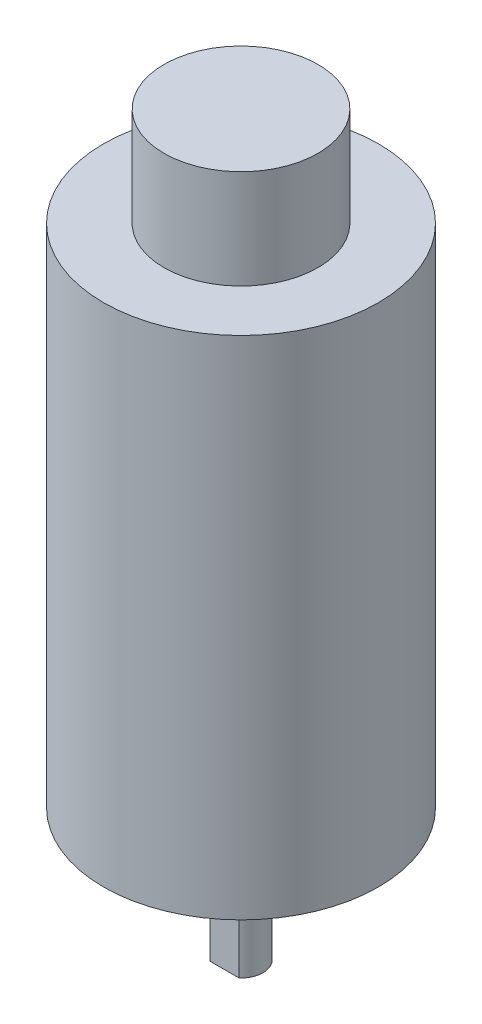
ISO-10303-21;
HEADER;
FILE_DESCRIPTION(('STEP AP214'),'2;1');
FILE_NAME('part.step','',(''),(''),'','','');
FILE_SCHEMA(('AUTOMOTIVE_DESIGN { 1 0 10303 214 1 1 1 1 }'));
ENDSEC;
DATA;
#1=APPLICATION_CONTEXT('core data for automotive mechanical design processes');
#2=APPLICATION_PROTOCOL_DEFINITION('international standard','automotive_design',2000,#1);
#3=PRODUCT_CONTEXT('',#1,'mechanical');
#4=PRODUCT('Part','Part','',(#3));
#5=PRODUCT_RELATED_PRODUCT_CATEGORY('part','',(#4));
#6=PRODUCT_DEFINITION_FORMATION('','',#4);
#7=PRODUCT_DEFINITION_CONTEXT('part definition',#1,'design');
#8=PRODUCT_DEFINITION('design','',#6,#7);
#9=PRODUCT_DEFINITION_SHAPE('','',#8);
#10=(LENGTH_UNIT() NAMED_UNIT(*) SI_UNIT(.MILLI.,.METRE.));
#11=(NAMED_UNIT(*) PLANE_ANGLE_UNIT() SI_UNIT($,.RADIAN.));
#12=(NAMED_UNIT(*) SI_UNIT($,.STERADIAN.) SOLID_ANGLE_UNIT());
#13=UNCERTAINTY_MEASURE_WITH_UNIT(LENGTH_MEASURE(1.E-05),#10,'distance_accuracy_value','');
#14=(GEOMETRIC_REPRESENTATION_CONTEXT(3) GLOBAL_UNCERTAINTY_ASSIGNED_CONTEXT((#13)) GLOBAL_UNIT_ASSIGNED_CONTEXT((#10,
#11,#12)) REPRESENTATION_CONTEXT('',''));
#15=CARTESIAN_POINT('',(0.,0.,0.));
#16=DIRECTION('',(0.,0.,1.));
#17=DIRECTION('',(1.,0.,0.));
#18=AXIS2_PLACEMENT_3D('',#15,#16,#17);
#19=CARTESIAN_POINT('',(0.,46.,0.));
#20=DIRECTION('',(0.,-1.,0.));
#21=DIRECTION('',(0.,0.,-1.));
#22=AXIS2_PLACEMENT_3D('',#19,#20,#21);
#23=CYLINDRICAL_SURFACE('',#22,12.5);
#24=CARTESIAN_POINT('',(0.,46.,0.));
#25=DIRECTION('',(0.,1.,0.));
#26=DIRECTION('',(0.,0.,1.));
#27=AXIS2_PLACEMENT_3D('',#24,#25,#26);
#28=CIRCLE('',#27,12.5);
#29=CARTESIAN_POINT('',(0.,46.,12.5));
#30=VERTEX_POINT('',#29);
#31=EDGE_CURVE('E47',#30,#30,#28,.T.);
#32=ORIENTED_EDGE('',*,*,#31,.F.);
#33=EDGE_LOOP('',(#32));
#34=FACE_BOUND('',#33,.T.);
#35=CARTESIAN_POINT('',(0.,0.,0.));
#36=DIRECTION('',(0.,1.,0.));
#37=DIRECTION('',(0.,0.,1.));
#38=AXIS2_PLACEMENT_3D('',#35,#36,#37);
#39=CIRCLE('',#38,12.5);
#40=CARTESIAN_POINT('',(0.,0.,12.5));
#41=VERTEX_POINT('',#40);
#42=EDGE_CURVE('E42',#41,#41,#39,.T.);
#43=ORIENTED_EDGE('',*,*,#42,.T.);
#44=EDGE_LOOP('',(#43));
#45=FACE_BOUND('',#44,.T.);
#46=ADVANCED_FACE('F39',(#34,#45),#23,.T.);
#47=CARTESIAN_POINT('',(0.,46.,0.));
#48=DIRECTION('',(0.,1.,0.));
#49=DIRECTION('',(0.,0.,1.));
#50=AXIS2_PLACEMENT_3D('',#47,#48,#49);
#51=PLANE('',#50);
#52=CARTESIAN_POINT('',(0.,46.,0.));
#53=DIRECTION('',(0.,1.,0.));
#54=DIRECTION('',(0.,0.,1.));
#55=AXIS2_PLACEMENT_3D('',#52,#53,#54);
#56=CIRCLE('',#55,7.);
#57=CARTESIAN_POINT('',(0.,46.,7.));
#58=VERTEX_POINT('',#57);
#59=EDGE_CURVE('E11',#58,#58,#56,.T.);
#60=ORIENTED_EDGE('',*,*,#59,.F.);
#61=EDGE_LOOP('',(#60));
#62=FACE_BOUND('',#61,.T.);
#63=ORIENTED_EDGE('',*,*,#31,.T.);
#64=EDGE_LOOP('',(#63));
#65=FACE_BOUND('',#64,.T.);
#66=ADVANCED_FACE('F105',(#62,#65),#51,.T.);
#67=CARTESIAN_POINT('',(0.,0.,0.));
#68=DIRECTION('',(0.,1.,0.));
#69=DIRECTION('',(0.,0.,1.));
#70=AXIS2_PLACEMENT_3D('',#67,#68,#69);
#71=PLANE('',#70);
#72=CARTESIAN_POINT('',(0.,0.,-8.5));
#73=DIRECTION('',(0.,1.,0.));
#74=DIRECTION('',(0.,0.,1.));
#75=AXIS2_PLACEMENT_3D('',#72,#73,#74);
#76=CIRCLE('',#75,1.5);
#77=CARTESIAN_POINT('',(0.,0.,-7.));
#78=VERTEX_POINT('',#77);
#79=EDGE_CURVE('E234',#78,#78,#76,.T.);
#80=ORIENTED_EDGE('',*,*,#79,.T.);
#81=EDGE_LOOP('',(#80));
#82=FACE_BOUND('',#81,.T.);
#83=CARTESIAN_POINT('',(0.,0.,8.5));
#84=DIRECTION('',(0.,1.,0.));
#85=DIRECTION('',(0.,0.,1.));
#86=AXIS2_PLACEMENT_3D('',#83,#84,#85);
#87=CIRCLE('',#86,1.5);
#88=CARTESIAN_POINT('',(0.,0.,10.));
#89=VERTEX_POINT('',#88);
#90=EDGE_CURVE('E236',#89,#89,#87,.T.);
#91=ORIENTED_EDGE('',*,*,#90,.T.);
#92=EDGE_LOOP('',(#91));
#93=FACE_BOUND('',#92,.T.);
#94=CARTESIAN_POINT('',(0.,0.,0.));
#95=DIRECTION('',(0.,1.,0.));
#96=DIRECTION('',(0.,0.,1.));
#97=AXIS2_PLACEMENT_3D('',#94,#95,#96);
#98=CIRCLE('',#97,3.5);
#99=CARTESIAN_POINT('',(0.,0.,3.5));
#100=VERTEX_POINT('',#99);
#101=EDGE_CURVE('E84',#100,#100,#98,.T.);
#102=ORIENTED_EDGE('',*,*,#101,.T.);
#103=EDGE_LOOP('',(#102));
#104=FACE_BOUND('',#103,.T.);
#105=ORIENTED_EDGE('',*,*,#42,.F.);
#106=EDGE_LOOP('',(#105));
#107=FACE_BOUND('',#106,.T.);
#108=ADVANCED_FACE('F102',(#82,#93,#104,#107),#71,.F.);
#109=CARTESIAN_POINT('',(0.,55.,0.));
#110=DIRECTION('',(0.,-1.,0.));
#111=DIRECTION('',(0.,0.,-1.));
#112=AXIS2_PLACEMENT_3D('',#109,#110,#111);
#113=CYLINDRICAL_SURFACE('',#112,7.);
#114=CARTESIAN_POINT('',(0.,55.,0.));
#115=DIRECTION('',(0.,1.,0.));
#116=DIRECTION('',(0.,0.,1.));
#117=AXIS2_PLACEMENT_3D('',#114,#115,#116);
#118=CIRCLE('',#117,7.);
#119=CARTESIAN_POINT('',(0.,55.,7.));
#120=VERTEX_POINT('',#119);
#121=EDGE_CURVE('E91',#120,#120,#118,.T.);
#122=ORIENTED_EDGE('',*,*,#121,.F.);
#123=EDGE_LOOP('',(#122));
#124=FACE_BOUND('',#123,.T.);
#125=ORIENTED_EDGE('',*,*,#59,.T.);
#126=EDGE_LOOP('',(#125));
#127=FACE_BOUND('',#126,.T.);
#128=ADVANCED_FACE('F104',(#124,#127),#113,.T.);
#129=CARTESIAN_POINT('',(0.,55.,0.));
#130=DIRECTION('',(0.,1.,0.));
#131=DIRECTION('',(0.,0.,1.));
#132=AXIS2_PLACEMENT_3D('',#129,#130,#131);
#133=PLANE('',#132);
#134=ORIENTED_EDGE('',*,*,#121,.T.);
#135=EDGE_LOOP('',(#134));
#136=FACE_BOUND('',#135,.T.);
#137=ADVANCED_FACE('F112',(#136),#133,.T.);
#138=CARTESIAN_POINT('',(0.,-2.5,0.));
#139=DIRECTION('',(0.,1.,0.));
#140=DIRECTION('',(0.,0.,1.));
#141=AXIS2_PLACEMENT_3D('',#138,#139,#140);
#142=CYLINDRICAL_SURFACE('',#141,3.5);
#143=CARTESIAN_POINT('',(0.,-2.5,0.));
#144=DIRECTION('',(0.,1.,0.));
#145=DIRECTION('',(0.,0.,1.));
#146=AXIS2_PLACEMENT_3D('',#143,#144,#145);
#147=CIRCLE('',#146,3.5);
#148=CARTESIAN_POINT('',(0.,-2.5,3.5));
#149=VERTEX_POINT('',#148);
#150=EDGE_CURVE('E88',#149,#149,#147,.T.);
#151=ORIENTED_EDGE('',*,*,#150,.T.);
#152=EDGE_LOOP('',(#151));
#153=FACE_BOUND('',#152,.T.);
#154=ORIENTED_EDGE('',*,*,#101,.F.);
#155=EDGE_LOOP('',(#154));
#156=FACE_BOUND('',#155,.T.);
#157=ADVANCED_FACE('F141',(#153,#156),#142,.T.);
#158=CARTESIAN_POINT('',(0.,-2.5,0.));
#159=DIRECTION('',(0.,1.,0.));
#160=DIRECTION('',(0.,0.,1.));
#161=AXIS2_PLACEMENT_3D('',#158,#159,#160);
#162=PLANE('',#161);
#163=CARTESIAN_POINT('',(0.,-2.5,0.));
#164=DIRECTION('',(0.,1.,0.));
#165=DIRECTION('',(0.,0.,1.));
#166=AXIS2_PLACEMENT_3D('',#163,#164,#165);
#167=CIRCLE('',#166,2.);
#168=CARTESIAN_POINT('',(0.,-2.5,2.));
#169=VERTEX_POINT('',#168);
#170=EDGE_CURVE('E81',#169,#169,#167,.T.);
#171=ORIENTED_EDGE('',*,*,#170,.T.);
#172=EDGE_LOOP('',(#171));
#173=FACE_BOUND('',#172,.T.);
#174=ORIENTED_EDGE('',*,*,#150,.F.);
#175=EDGE_LOOP('',(#174));
#176=FACE_BOUND('',#175,.T.);
#177=ADVANCED_FACE('F150',(#173,#176),#162,.F.);
#178=CARTESIAN_POINT('',(0.,-12.,0.));
#179=DIRECTION('',(0.,1.,0.));
#180=DIRECTION('',(0.,0.,1.));
#181=AXIS2_PLACEMENT_3D('',#178,#179,#180);
#182=CYLINDRICAL_SURFACE('',#181,2.);
#183=DIRECTION('',(0.,-1.,0.));
#184=VECTOR('',#183,1.);
#185=CARTESIAN_POINT('',(-1.3228756555323,-4.,1.5));
#186=LINE('',#185,#184);
#187=CARTESIAN_POINT('',(-1.3228756555323,-4.,1.5));
#188=VERTEX_POINT('',#187);
#189=CARTESIAN_POINT('',(-1.3228756555323,-12.,1.5));
#190=VERTEX_POINT('',#189);
#191=EDGE_CURVE('E55',#188,#190,#186,.T.);
#192=ORIENTED_EDGE('',*,*,#191,.F.);
#193=CARTESIAN_POINT('',(0.,-4.,0.));
#194=DIRECTION('',(0.,-1.,0.));
#195=DIRECTION('',(0.,0.,-1.));
#196=AXIS2_PLACEMENT_3D('',#193,#194,#195);
#197=CIRCLE('',#196,2.);
#198=CARTESIAN_POINT('',(1.3228756555323,-4.,1.5));
#199=VERTEX_POINT('',#198);
#200=EDGE_CURVE('E71',#199,#188,#197,.T.);
#201=ORIENTED_EDGE('',*,*,#200,.F.);
#202=DIRECTION('',(0.,-1.,0.));
#203=VECTOR('',#202,1.);
#204=CARTESIAN_POINT('',(1.3228756555323,-4.,1.5));
#205=LINE('',#204,#203);
#206=CARTESIAN_POINT('',(1.3228756555323,-12.,1.5));
#207=VERTEX_POINT('',#206);
#208=EDGE_CURVE('E61',#199,#207,#205,.T.);
#209=ORIENTED_EDGE('',*,*,#208,.T.);
#210=CARTESIAN_POINT('',(0.,-12.,0.));
#211=DIRECTION('',(0.,1.,0.));
#212=DIRECTION('',(0.,0.,1.));
#213=AXIS2_PLACEMENT_3D('',#210,#211,#212);
#214=CIRCLE('',#213,2.);
#215=EDGE_CURVE('E78',#207,#190,#214,.T.);
#216=ORIENTED_EDGE('',*,*,#215,.T.);
#217=EDGE_LOOP('',(#192,#201,#209,#216));
#218=FACE_BOUND('',#217,.T.);
#219=ORIENTED_EDGE('',*,*,#170,.F.);
#220=EDGE_LOOP('',(#219));
#221=FACE_BOUND('',#220,.T.);
#222=ADVANCED_FACE('F76',(#218,#221),#182,.T.);
#223=CARTESIAN_POINT('',(0.,-12.,0.));
#224=DIRECTION('',(0.,1.,0.));
#225=DIRECTION('',(0.,0.,1.));
#226=AXIS2_PLACEMENT_3D('',#223,#224,#225);
#227=PLANE('',#226);
#228=ORIENTED_EDGE('',*,*,#215,.F.);
#229=DIRECTION('',(1.,0.,0.));
#230=VECTOR('',#229,1.);
#231=CARTESIAN_POINT('',(-1.3228756555323,-12.,1.5));
#232=LINE('',#231,#230);
#233=EDGE_CURVE('E66',#190,#207,#232,.T.);
#234=ORIENTED_EDGE('',*,*,#233,.F.);
#235=EDGE_LOOP('',(#228,#234));
#236=FACE_BOUND('',#235,.T.);
#237=ADVANCED_FACE('F80',(#236),#227,.F.);
#238=CARTESIAN_POINT('',(-1.3228756555323,-4.,1.5));
#239=DIRECTION('',(0.,0.,-1.));
#240=DIRECTION('',(-1.,0.,0.));
#241=AXIS2_PLACEMENT_3D('',#238,#239,#240);
#242=PLANE('',#241);
#243=ORIENTED_EDGE('',*,*,#233,.T.);
#244=ORIENTED_EDGE('',*,*,#208,.F.);
#245=DIRECTION('',(1.,0.,0.));
#246=VECTOR('',#245,1.);
#247=CARTESIAN_POINT('',(-1.3228756555323,-4.,1.5));
#248=LINE('',#247,#246);
#249=EDGE_CURVE('E245',#188,#199,#248,.T.);
#250=ORIENTED_EDGE('',*,*,#249,.F.);
#251=ORIENTED_EDGE('',*,*,#191,.T.);
#252=EDGE_LOOP('',(#243,#244,#250,#251));
#253=FACE_BOUND('',#252,.T.);
#254=ADVANCED_FACE('F67',(#253),#242,.F.);
#255=CARTESIAN_POINT('',(0.,-4.,0.));
#256=DIRECTION('',(0.,-1.,0.));
#257=DIRECTION('',(0.,0.,-1.));
#258=AXIS2_PLACEMENT_3D('',#255,#256,#257);
#259=PLANE('',#258);
#260=ORIENTED_EDGE('',*,*,#200,.T.);
#261=ORIENTED_EDGE('',*,*,#249,.T.);
#262=EDGE_LOOP('',(#260,#261));
#263=FACE_BOUND('',#262,.T.);
#264=ADVANCED_FACE('F180',(#263),#259,.T.);
#265=CARTESIAN_POINT('',(0.,4.,8.5));
#266=DIRECTION('',(0.,-1.,0.));
#267=DIRECTION('',(0.,0.,-1.));
#268=AXIS2_PLACEMENT_3D('',#265,#266,#267);
#269=CYLINDRICAL_SURFACE('',#268,1.5);
#270=CARTESIAN_POINT('',(0.,4.,8.5));
#271=DIRECTION('',(0.,1.,0.));
#272=DIRECTION('',(0.,0.,1.));
#273=AXIS2_PLACEMENT_3D('',#270,#271,#272);
#274=CIRCLE('',#273,1.5);
#275=CARTESIAN_POINT('',(0.,4.,10.));
#276=VERTEX_POINT('',#275);
#277=EDGE_CURVE('E241',#276,#276,#274,.T.);
#278=ORIENTED_EDGE('',*,*,#277,.T.);
#279=EDGE_LOOP('',(#278));
#280=FACE_BOUND('',#279,.T.);
#281=ORIENTED_EDGE('',*,*,#90,.F.);
#282=EDGE_LOOP('',(#281));
#283=FACE_BOUND('',#282,.T.);
#284=ADVANCED_FACE('F187',(#280,#283),#269,.F.);
#285=CARTESIAN_POINT('',(0.,4.,8.5));
#286=DIRECTION('',(0.,1.,0.));
#287=DIRECTION('',(0.,0.,1.));
#288=AXIS2_PLACEMENT_3D('',#285,#286,#287);
#289=PLANE('',#288);
#290=ORIENTED_EDGE('',*,*,#277,.F.);
#291=EDGE_LOOP('',(#290));
#292=FACE_BOUND('',#291,.T.);
#293=ADVANCED_FACE('F199',(#292),#289,.F.);
#294=CARTESIAN_POINT('',(0.,4.,-8.5));
#295=DIRECTION('',(0.,-1.,0.));
#296=DIRECTION('',(0.,0.,-1.));
#297=AXIS2_PLACEMENT_3D('',#294,#295,#296);
#298=CYLINDRICAL_SURFACE('',#297,1.5);
#299=CARTESIAN_POINT('',(0.,4.,-8.5));
#300=DIRECTION('',(0.,1.,0.));
#301=DIRECTION('',(0.,0.,1.));
#302=AXIS2_PLACEMENT_3D('',#299,#300,#301);
#303=CIRCLE('',#302,1.5);
#304=CARTESIAN_POINT('',(0.,4.,-7.));
#305=VERTEX_POINT('',#304);
#306=EDGE_CURVE('E72',#305,#305,#303,.T.);
#307=ORIENTED_EDGE('',*,*,#306,.T.);
#308=EDGE_LOOP('',(#307));
#309=FACE_BOUND('',#308,.T.);
#310=ORIENTED_EDGE('',*,*,#79,.F.);
#311=EDGE_LOOP('',(#310));
#312=FACE_BOUND('',#311,.T.);
#313=ADVANCED_FACE('F209',(#309,#312),#298,.F.);
#314=CARTESIAN_POINT('',(0.,4.,-8.5));
#315=DIRECTION('',(0.,1.,0.));
#316=DIRECTION('',(0.,0.,1.));
#317=AXIS2_PLACEMENT_3D('',#314,#315,#316);
#318=PLANE('',#317);
#319=ORIENTED_EDGE('',*,*,#306,.F.);
#320=EDGE_LOOP('',(#319));
#321=FACE_BOUND('',#320,.T.);
#322=ADVANCED_FACE('F219',(#321),#318,.F.);
#323=CLOSED_SHELL('',(#46,#66,#108,#128,#137,#157,#177,#222,#237,#254,#264,#284,#293,#313,#322));
#324=MANIFOLD_SOLID_BREP('B2',#323);
#325=ADVANCED_BREP_SHAPE_REPRESENTATION('',(#18,#324),#14);
#326=SHAPE_DEFINITION_REPRESENTATION(#9,#325);
ENDSEC;
END-ISO-10303-21;
